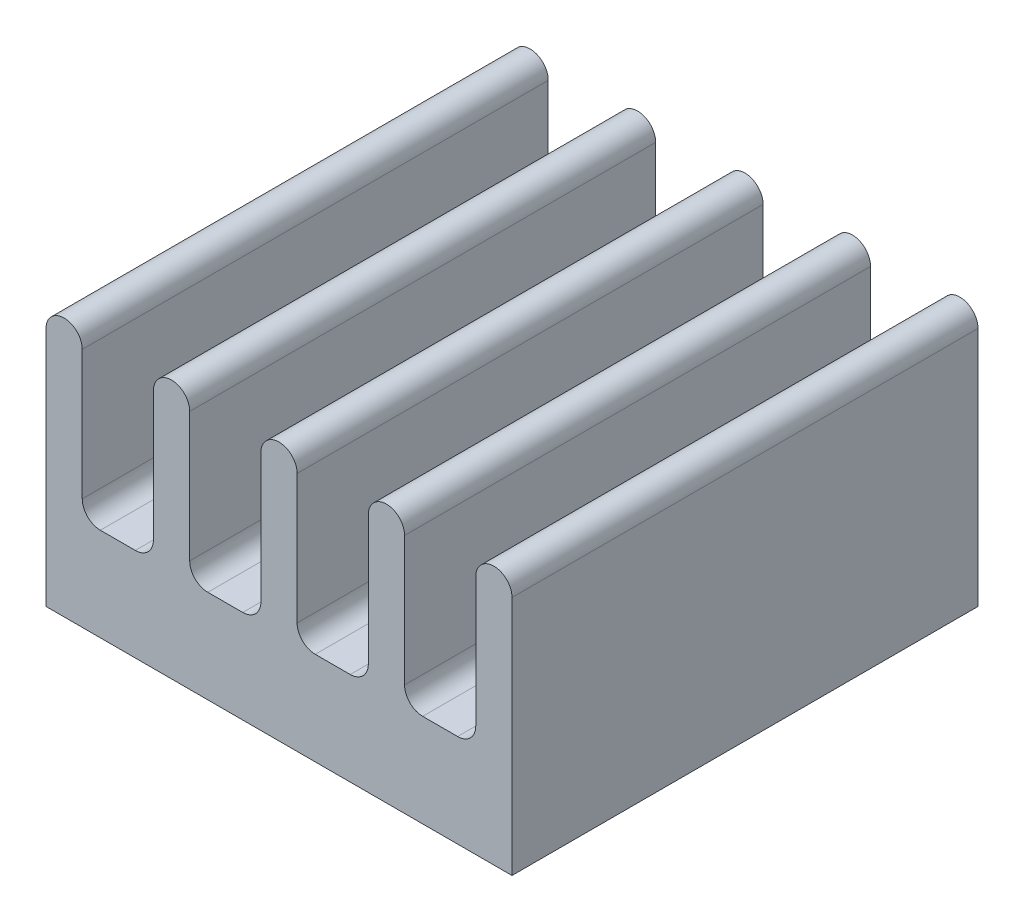
ISO-10303-21;
HEADER;
FILE_DESCRIPTION(('STEP AP214'),'2;1');
FILE_NAME('part.step','',(''),(''),'','','');
FILE_SCHEMA(('AUTOMOTIVE_DESIGN { 1 0 10303 214 1 1 1 1 }'));
ENDSEC;
DATA;
#1=APPLICATION_CONTEXT('core data for automotive mechanical design processes');
#2=APPLICATION_PROTOCOL_DEFINITION('international standard','automotive_design',2000,#1);
#3=PRODUCT_CONTEXT('',#1,'mechanical');
#4=PRODUCT('Part','Part','',(#3));
#5=PRODUCT_RELATED_PRODUCT_CATEGORY('part','',(#4));
#6=PRODUCT_DEFINITION_FORMATION('','',#4);
#7=PRODUCT_DEFINITION_CONTEXT('part definition',#1,'design');
#8=PRODUCT_DEFINITION('design','',#6,#7);
#9=PRODUCT_DEFINITION_SHAPE('','',#8);
#10=(LENGTH_UNIT() NAMED_UNIT(*) SI_UNIT(.MILLI.,.METRE.));
#11=(NAMED_UNIT(*) PLANE_ANGLE_UNIT() SI_UNIT($,.RADIAN.));
#12=(NAMED_UNIT(*) SI_UNIT($,.STERADIAN.) SOLID_ANGLE_UNIT());
#13=UNCERTAINTY_MEASURE_WITH_UNIT(LENGTH_MEASURE(1.E-05),#10,'distance_accuracy_value','');
#14=(GEOMETRIC_REPRESENTATION_CONTEXT(3) GLOBAL_UNCERTAINTY_ASSIGNED_CONTEXT((#13)) GLOBAL_UNIT_ASSIGNED_CONTEXT((#10,
#11,#12)) REPRESENTATION_CONTEXT('',''));
#15=CARTESIAN_POINT('',(0.,0.,0.));
#16=DIRECTION('',(0.,0.,1.));
#17=DIRECTION('',(1.,0.,0.));
#18=AXIS2_PLACEMENT_3D('',#15,#16,#17);
#19=CARTESIAN_POINT('',(4.15,1.8,43.));
#20=DIRECTION('',(0.,1.,0.));
#21=DIRECTION('',(0.,0.,1.));
#22=AXIS2_PLACEMENT_3D('',#19,#20,#21);
#23=PLANE('',#22);
#24=DIRECTION('',(0.,0.,1.));
#25=VECTOR('',#24,1.);
#26=CARTESIAN_POINT('',(2.775,1.8,45.25));
#27=LINE('',#26,#25);
#28=CARTESIAN_POINT('',(2.775,1.8,38.5));
#29=VERTEX_POINT('',#28);
#30=CARTESIAN_POINT('',(2.775,1.8,47.5));
#31=VERTEX_POINT('',#30);
#32=EDGE_CURVE('E284',#29,#31,#27,.T.);
#33=ORIENTED_EDGE('',*,*,#32,.T.);
#34=DIRECTION('',(1.,0.,0.));
#35=VECTOR('',#34,1.);
#36=CARTESIAN_POINT('',(4.15,1.8,47.5));
#37=LINE('',#36,#35);
#38=CARTESIAN_POINT('',(3.45,1.8,47.5));
#39=VERTEX_POINT('',#38);
#40=EDGE_CURVE('E207',#31,#39,#37,.T.);
#41=ORIENTED_EDGE('',*,*,#40,.T.);
#42=DIRECTION('',(0.,0.,-1.));
#43=VECTOR('',#42,1.);
#44=CARTESIAN_POINT('',(3.45,1.8,40.75));
#45=LINE('',#44,#43);
#46=CARTESIAN_POINT('',(3.45,1.8,38.5));
#47=VERTEX_POINT('',#46);
#48=EDGE_CURVE('E212',#39,#47,#45,.T.);
#49=ORIENTED_EDGE('',*,*,#48,.T.);
#50=DIRECTION('',(1.,0.,0.));
#51=VECTOR('',#50,1.);
#52=CARTESIAN_POINT('',(4.15,1.8,38.5));
#53=LINE('',#52,#51);
#54=EDGE_CURVE('E196',#47,#29,#53,.F.);
#55=ORIENTED_EDGE('',*,*,#54,.T.);
#56=EDGE_LOOP('',(#33,#41,#49,#55));
#57=FACE_BOUND('',#56,.T.);
#58=ADVANCED_FACE('F16',(#57),#23,.T.);
#59=CARTESIAN_POINT('',(4.15,1.8,43.));
#60=DIRECTION('',(0.,1.,0.));
#61=DIRECTION('',(0.,0.,1.));
#62=AXIS2_PLACEMENT_3D('',#59,#60,#61);
#63=PLANE('',#62);
#64=DIRECTION('',(0.,0.,1.));
#65=VECTOR('',#64,1.);
#66=CARTESIAN_POINT('',(0.7,1.8,45.25));
#67=LINE('',#66,#65);
#68=CARTESIAN_POINT('',(0.7,1.8,38.5));
#69=VERTEX_POINT('',#68);
#70=CARTESIAN_POINT('',(0.7,1.8,47.5));
#71=VERTEX_POINT('',#70);
#72=EDGE_CURVE('E271',#69,#71,#67,.T.);
#73=ORIENTED_EDGE('',*,*,#72,.T.);
#74=DIRECTION('',(1.,0.,0.));
#75=VECTOR('',#74,1.);
#76=CARTESIAN_POINT('',(4.15,1.8,47.5));
#77=LINE('',#76,#75);
#78=CARTESIAN_POINT('',(1.375,1.8,47.5));
#79=VERTEX_POINT('',#78);
#80=EDGE_CURVE('E290',#71,#79,#77,.T.);
#81=ORIENTED_EDGE('',*,*,#80,.T.);
#82=DIRECTION('',(0.,0.,-1.));
#83=VECTOR('',#82,1.);
#84=CARTESIAN_POINT('',(1.375,1.8,40.75));
#85=LINE('',#84,#83);
#86=CARTESIAN_POINT('',(1.375,1.8,38.5));
#87=VERTEX_POINT('',#86);
#88=EDGE_CURVE('E281',#79,#87,#85,.T.);
#89=ORIENTED_EDGE('',*,*,#88,.T.);
#90=DIRECTION('',(1.,0.,0.));
#91=VECTOR('',#90,1.);
#92=CARTESIAN_POINT('',(4.15,1.8,38.5));
#93=LINE('',#92,#91);
#94=EDGE_CURVE('E293',#87,#69,#93,.F.);
#95=ORIENTED_EDGE('',*,*,#94,.T.);
#96=EDGE_LOOP('',(#73,#81,#89,#95));
#97=FACE_BOUND('',#96,.T.);
#98=ADVANCED_FACE('F538',(#97),#63,.T.);
#99=CARTESIAN_POINT('',(4.15,1.8,43.));
#100=DIRECTION('',(0.,1.,0.));
#101=DIRECTION('',(0.,0.,1.));
#102=AXIS2_PLACEMENT_3D('',#99,#100,#101);
#103=PLANE('',#102);
#104=DIRECTION('',(0.,0.,1.));
#105=VECTOR('',#104,1.);
#106=CARTESIAN_POINT('',(-1.375,1.8,45.25));
#107=LINE('',#106,#105);
#108=CARTESIAN_POINT('',(-1.375,1.8,38.5));
#109=VERTEX_POINT('',#108);
#110=CARTESIAN_POINT('',(-1.375,1.8,47.5));
#111=VERTEX_POINT('',#110);
#112=EDGE_CURVE('E255',#109,#111,#107,.T.);
#113=ORIENTED_EDGE('',*,*,#112,.T.);
#114=DIRECTION('',(1.,0.,0.));
#115=VECTOR('',#114,1.);
#116=CARTESIAN_POINT('',(4.15,1.8,47.5));
#117=LINE('',#116,#115);
#118=CARTESIAN_POINT('',(-0.7,1.8,47.5));
#119=VERTEX_POINT('',#118);
#120=EDGE_CURVE('E299',#111,#119,#117,.T.);
#121=ORIENTED_EDGE('',*,*,#120,.T.);
#122=DIRECTION('',(0.,0.,-1.));
#123=VECTOR('',#122,1.);
#124=CARTESIAN_POINT('',(-0.7,1.8,40.75));
#125=LINE('',#124,#123);
#126=CARTESIAN_POINT('',(-0.7,1.8,38.5));
#127=VERTEX_POINT('',#126);
#128=EDGE_CURVE('E265',#119,#127,#125,.T.);
#129=ORIENTED_EDGE('',*,*,#128,.T.);
#130=DIRECTION('',(1.,0.,0.));
#131=VECTOR('',#130,1.);
#132=CARTESIAN_POINT('',(4.15,1.8,38.5));
#133=LINE('',#132,#131);
#134=EDGE_CURVE('E292',#127,#109,#133,.F.);
#135=ORIENTED_EDGE('',*,*,#134,.T.);
#136=EDGE_LOOP('',(#113,#121,#129,#135));
#137=FACE_BOUND('',#136,.T.);
#138=ADVANCED_FACE('F535',(#137),#103,.T.);
#139=CARTESIAN_POINT('',(4.15,1.8,43.));
#140=DIRECTION('',(0.,1.,0.));
#141=DIRECTION('',(0.,0.,1.));
#142=AXIS2_PLACEMENT_3D('',#139,#140,#141);
#143=PLANE('',#142);
#144=DIRECTION('',(0.,0.,1.));
#145=VECTOR('',#144,1.);
#146=CARTESIAN_POINT('',(-3.45,1.8,45.25));
#147=LINE('',#146,#145);
#148=CARTESIAN_POINT('',(-3.45,1.8,38.5));
#149=VERTEX_POINT('',#148);
#150=CARTESIAN_POINT('',(-3.45,1.8,47.5));
#151=VERTEX_POINT('',#150);
#152=EDGE_CURVE('E239',#149,#151,#147,.T.);
#153=ORIENTED_EDGE('',*,*,#152,.T.);
#154=DIRECTION('',(1.,0.,0.));
#155=VECTOR('',#154,1.);
#156=CARTESIAN_POINT('',(4.15,1.8,47.5));
#157=LINE('',#156,#155);
#158=CARTESIAN_POINT('',(-2.775,1.8,47.5));
#159=VERTEX_POINT('',#158);
#160=EDGE_CURVE('E218',#151,#159,#157,.T.);
#161=ORIENTED_EDGE('',*,*,#160,.T.);
#162=DIRECTION('',(0.,0.,-1.));
#163=VECTOR('',#162,1.);
#164=CARTESIAN_POINT('',(-2.775,1.8,40.75));
#165=LINE('',#164,#163);
#166=CARTESIAN_POINT('',(-2.775,1.8,38.5));
#167=VERTEX_POINT('',#166);
#168=EDGE_CURVE('E249',#159,#167,#165,.T.);
#169=ORIENTED_EDGE('',*,*,#168,.T.);
#170=DIRECTION('',(1.,0.,0.));
#171=VECTOR('',#170,1.);
#172=CARTESIAN_POINT('',(4.15,1.8,38.5));
#173=LINE('',#172,#171);
#174=EDGE_CURVE('E220',#167,#149,#173,.F.);
#175=ORIENTED_EDGE('',*,*,#174,.T.);
#176=EDGE_LOOP('',(#153,#161,#169,#175));
#177=FACE_BOUND('',#176,.T.);
#178=ADVANCED_FACE('F529',(#177),#143,.T.);
#179=CARTESIAN_POINT('',(3.45,2.15,40.75));
#180=DIRECTION('',(0.,0.,-1.));
#181=DIRECTION('',(-1.,0.,0.));
#182=AXIS2_PLACEMENT_3D('',#179,#180,#181);
#183=CYLINDRICAL_SURFACE('',#182,0.35);
#184=DIRECTION('',(0.,0.,1.));
#185=VECTOR('',#184,1.);
#186=CARTESIAN_POINT('',(3.8,2.15,38.5));
#187=LINE('',#186,#185);
#188=CARTESIAN_POINT('',(3.8,2.15,38.5));
#189=VERTEX_POINT('',#188);
#190=CARTESIAN_POINT('',(3.8,2.15,47.5));
#191=VERTEX_POINT('',#190);
#192=EDGE_CURVE('E215',#189,#191,#187,.T.);
#193=ORIENTED_EDGE('',*,*,#192,.F.);
#194=CARTESIAN_POINT('',(3.45,2.15,38.5));
#195=DIRECTION('',(0.,0.,-1.));
#196=DIRECTION('',(-1.,0.,0.));
#197=AXIS2_PLACEMENT_3D('',#194,#195,#196);
#198=CIRCLE('',#197,0.35);
#199=EDGE_CURVE('E19',#47,#189,#198,.F.);
#200=ORIENTED_EDGE('',*,*,#199,.F.);
#201=ORIENTED_EDGE('',*,*,#48,.F.);
#202=CARTESIAN_POINT('',(3.45,2.15,47.5));
#203=DIRECTION('',(0.,0.,-1.));
#204=DIRECTION('',(-1.,0.,0.));
#205=AXIS2_PLACEMENT_3D('',#202,#203,#204);
#206=CIRCLE('',#205,0.35);
#207=EDGE_CURVE('E217',#191,#39,#206,.T.);
#208=ORIENTED_EDGE('',*,*,#207,.F.);
#209=EDGE_LOOP('',(#193,#200,#201,#208));
#210=FACE_BOUND('',#209,.T.);
#211=ADVANCED_FACE('F211',(#210),#183,.F.);
#212=CARTESIAN_POINT('',(2.775,2.15,45.25));
#213=DIRECTION('',(0.,0.,1.));
#214=DIRECTION('',(1.,0.,0.));
#215=AXIS2_PLACEMENT_3D('',#212,#213,#214);
#216=CYLINDRICAL_SURFACE('',#215,0.35);
#217=DIRECTION('',(0.,0.,-1.));
#218=VECTOR('',#217,1.);
#219=CARTESIAN_POINT('',(2.425,2.15,47.5));
#220=LINE('',#219,#218);
#221=CARTESIAN_POINT('',(2.425,2.15,47.5));
#222=VERTEX_POINT('',#221);
#223=CARTESIAN_POINT('',(2.425,2.15,38.5));
#224=VERTEX_POINT('',#223);
#225=EDGE_CURVE('E325',#222,#224,#220,.T.);
#226=ORIENTED_EDGE('',*,*,#225,.F.);
#227=CARTESIAN_POINT('',(2.775,2.15,47.5));
#228=DIRECTION('',(0.,0.,1.));
#229=DIRECTION('',(1.,0.,0.));
#230=AXIS2_PLACEMENT_3D('',#227,#228,#229);
#231=CIRCLE('',#230,0.35);
#232=EDGE_CURVE('E283',#31,#222,#231,.F.);
#233=ORIENTED_EDGE('',*,*,#232,.F.);
#234=ORIENTED_EDGE('',*,*,#32,.F.);
#235=CARTESIAN_POINT('',(2.775,2.15,38.5));
#236=DIRECTION('',(0.,0.,1.));
#237=DIRECTION('',(1.,0.,0.));
#238=AXIS2_PLACEMENT_3D('',#235,#236,#237);
#239=CIRCLE('',#238,0.35);
#240=EDGE_CURVE('E202',#224,#29,#239,.T.);
#241=ORIENTED_EDGE('',*,*,#240,.F.);
#242=EDGE_LOOP('',(#226,#233,#234,#241));
#243=FACE_BOUND('',#242,.T.);
#244=ADVANCED_FACE('F521',(#243),#216,.F.);
#245=CARTESIAN_POINT('',(1.375,2.15,40.75));
#246=DIRECTION('',(0.,0.,-1.));
#247=DIRECTION('',(-1.,0.,0.));
#248=AXIS2_PLACEMENT_3D('',#245,#246,#247);
#249=CYLINDRICAL_SURFACE('',#248,0.35);
#250=DIRECTION('',(0.,0.,1.));
#251=VECTOR('',#250,1.);
#252=CARTESIAN_POINT('',(1.725,2.15,38.5));
#253=LINE('',#252,#251);
#254=CARTESIAN_POINT('',(1.725,2.15,38.5));
#255=VERTEX_POINT('',#254);
#256=CARTESIAN_POINT('',(1.725,2.15,47.5));
#257=VERTEX_POINT('',#256);
#258=EDGE_CURVE('E329',#255,#257,#253,.T.);
#259=ORIENTED_EDGE('',*,*,#258,.F.);
#260=CARTESIAN_POINT('',(1.375,2.15,38.5));
#261=DIRECTION('',(0.,0.,-1.));
#262=DIRECTION('',(-1.,0.,0.));
#263=AXIS2_PLACEMENT_3D('',#260,#261,#262);
#264=CIRCLE('',#263,0.35);
#265=EDGE_CURVE('E279',#87,#255,#264,.F.);
#266=ORIENTED_EDGE('',*,*,#265,.F.);
#267=ORIENTED_EDGE('',*,*,#88,.F.);
#268=CARTESIAN_POINT('',(1.375,2.15,47.5));
#269=DIRECTION('',(0.,0.,-1.));
#270=DIRECTION('',(-1.,0.,0.));
#271=AXIS2_PLACEMENT_3D('',#268,#269,#270);
#272=CIRCLE('',#271,0.35);
#273=EDGE_CURVE('E276',#257,#79,#272,.T.);
#274=ORIENTED_EDGE('',*,*,#273,.F.);
#275=EDGE_LOOP('',(#259,#266,#267,#274));
#276=FACE_BOUND('',#275,.T.);
#277=ADVANCED_FACE('F514',(#276),#249,.F.);
#278=CARTESIAN_POINT('',(2.075,4.65,40.75));
#279=DIRECTION('',(0.,0.,1.));
#280=DIRECTION('',(1.,0.,0.));
#281=AXIS2_PLACEMENT_3D('',#278,#279,#280);
#282=CYLINDRICAL_SURFACE('',#281,0.35);
#283=CARTESIAN_POINT('',(2.075,4.65,38.5));
#284=DIRECTION('',(0.,0.,1.));
#285=DIRECTION('',(1.,0.,0.));
#286=AXIS2_PLACEMENT_3D('',#283,#284,#285);
#287=CIRCLE('',#286,0.35);
#288=CARTESIAN_POINT('',(2.425,4.65,38.5));
#289=VERTEX_POINT('',#288);
#290=CARTESIAN_POINT('',(1.725,4.65,38.5));
#291=VERTEX_POINT('',#290);
#292=EDGE_CURVE('E272',#289,#291,#287,.T.);
#293=ORIENTED_EDGE('',*,*,#292,.T.);
#294=DIRECTION('',(0.,0.,1.));
#295=VECTOR('',#294,1.);
#296=CARTESIAN_POINT('',(1.725,4.65,38.5));
#297=LINE('',#296,#295);
#298=CARTESIAN_POINT('',(1.725,4.65,47.5));
#299=VERTEX_POINT('',#298);
#300=EDGE_CURVE('E334',#299,#291,#297,.F.);
#301=ORIENTED_EDGE('',*,*,#300,.F.);
#302=CARTESIAN_POINT('',(2.075,4.65,47.5));
#303=DIRECTION('',(0.,0.,1.));
#304=DIRECTION('',(1.,0.,0.));
#305=AXIS2_PLACEMENT_3D('',#302,#303,#304);
#306=CIRCLE('',#305,0.35);
#307=CARTESIAN_POINT('',(2.425,4.65,47.5));
#308=VERTEX_POINT('',#307);
#309=EDGE_CURVE('E274',#299,#308,#306,.F.);
#310=ORIENTED_EDGE('',*,*,#309,.T.);
#311=DIRECTION('',(0.,0.,-1.));
#312=VECTOR('',#311,1.);
#313=CARTESIAN_POINT('',(2.425,4.65,47.5));
#314=LINE('',#313,#312);
#315=EDGE_CURVE('E326',#289,#308,#314,.F.);
#316=ORIENTED_EDGE('',*,*,#315,.F.);
#317=EDGE_LOOP('',(#293,#301,#310,#316));
#318=FACE_BOUND('',#317,.T.);
#319=ADVANCED_FACE('F516',(#318),#282,.T.);
#320=CARTESIAN_POINT('',(0.7,2.15,45.25));
#321=DIRECTION('',(0.,0.,1.));
#322=DIRECTION('',(1.,0.,0.));
#323=AXIS2_PLACEMENT_3D('',#320,#321,#322);
#324=CYLINDRICAL_SURFACE('',#323,0.35);
#325=DIRECTION('',(0.,0.,-1.));
#326=VECTOR('',#325,1.);
#327=CARTESIAN_POINT('',(0.35,2.15,47.5));
#328=LINE('',#327,#326);
#329=CARTESIAN_POINT('',(0.35,2.15,47.5));
#330=VERTEX_POINT('',#329);
#331=CARTESIAN_POINT('',(0.35,2.15,38.5));
#332=VERTEX_POINT('',#331);
#333=EDGE_CURVE('E337',#330,#332,#328,.T.);
#334=ORIENTED_EDGE('',*,*,#333,.F.);
#335=CARTESIAN_POINT('',(0.7,2.15,47.5));
#336=DIRECTION('',(0.,0.,1.));
#337=DIRECTION('',(1.,0.,0.));
#338=AXIS2_PLACEMENT_3D('',#335,#336,#337);
#339=CIRCLE('',#338,0.35);
#340=EDGE_CURVE('E269',#71,#330,#339,.F.);
#341=ORIENTED_EDGE('',*,*,#340,.F.);
#342=ORIENTED_EDGE('',*,*,#72,.F.);
#343=CARTESIAN_POINT('',(0.7,2.15,38.5));
#344=DIRECTION('',(0.,0.,1.));
#345=DIRECTION('',(1.,0.,0.));
#346=AXIS2_PLACEMENT_3D('',#343,#344,#345);
#347=CIRCLE('',#346,0.35);
#348=EDGE_CURVE('E266',#332,#69,#347,.T.);
#349=ORIENTED_EDGE('',*,*,#348,.F.);
#350=EDGE_LOOP('',(#334,#341,#342,#349));
#351=FACE_BOUND('',#350,.T.);
#352=ADVANCED_FACE('F549',(#351),#324,.F.);
#353=CARTESIAN_POINT('',(-0.7,2.15,40.75));
#354=DIRECTION('',(0.,0.,-1.));
#355=DIRECTION('',(-1.,0.,0.));
#356=AXIS2_PLACEMENT_3D('',#353,#354,#355);
#357=CYLINDRICAL_SURFACE('',#356,0.35);
#358=DIRECTION('',(0.,0.,1.));
#359=VECTOR('',#358,1.);
#360=CARTESIAN_POINT('',(-0.35,2.15,38.5));
#361=LINE('',#360,#359);
#362=CARTESIAN_POINT('',(-0.35,2.15,38.5));
#363=VERTEX_POINT('',#362);
#364=CARTESIAN_POINT('',(-0.35,2.15,47.5));
#365=VERTEX_POINT('',#364);
#366=EDGE_CURVE('E341',#363,#365,#361,.T.);
#367=ORIENTED_EDGE('',*,*,#366,.F.);
#368=CARTESIAN_POINT('',(-0.7,2.15,38.5));
#369=DIRECTION('',(0.,0.,-1.));
#370=DIRECTION('',(-1.,0.,0.));
#371=AXIS2_PLACEMENT_3D('',#368,#369,#370);
#372=CIRCLE('',#371,0.35);
#373=EDGE_CURVE('E263',#127,#363,#372,.F.);
#374=ORIENTED_EDGE('',*,*,#373,.F.);
#375=ORIENTED_EDGE('',*,*,#128,.F.);
#376=CARTESIAN_POINT('',(-0.7,2.15,47.5));
#377=DIRECTION('',(0.,0.,-1.));
#378=DIRECTION('',(-1.,0.,0.));
#379=AXIS2_PLACEMENT_3D('',#376,#377,#378);
#380=CIRCLE('',#379,0.35);
#381=EDGE_CURVE('E260',#365,#119,#380,.T.);
#382=ORIENTED_EDGE('',*,*,#381,.F.);
#383=EDGE_LOOP('',(#367,#374,#375,#382));
#384=FACE_BOUND('',#383,.T.);
#385=ADVANCED_FACE('F561',(#384),#357,.F.);
#386=CARTESIAN_POINT('',(0.,4.65,40.75));
#387=DIRECTION('',(0.,0.,1.));
#388=DIRECTION('',(1.,0.,0.));
#389=AXIS2_PLACEMENT_3D('',#386,#387,#388);
#390=CYLINDRICAL_SURFACE('',#389,0.35);
#391=CARTESIAN_POINT('',(0.,4.65,38.5));
#392=DIRECTION('',(0.,0.,1.));
#393=DIRECTION('',(1.,0.,0.));
#394=AXIS2_PLACEMENT_3D('',#391,#392,#393);
#395=CIRCLE('',#394,0.35);
#396=CARTESIAN_POINT('',(0.35,4.65,38.5));
#397=VERTEX_POINT('',#396);
#398=CARTESIAN_POINT('',(-0.35,4.65,38.5));
#399=VERTEX_POINT('',#398);
#400=EDGE_CURVE('E256',#397,#399,#395,.T.);
#401=ORIENTED_EDGE('',*,*,#400,.T.);
#402=DIRECTION('',(0.,0.,1.));
#403=VECTOR('',#402,1.);
#404=CARTESIAN_POINT('',(-0.35,4.65,38.5));
#405=LINE('',#404,#403);
#406=CARTESIAN_POINT('',(-0.35,4.65,47.5));
#407=VERTEX_POINT('',#406);
#408=EDGE_CURVE('E346',#407,#399,#405,.F.);
#409=ORIENTED_EDGE('',*,*,#408,.F.);
#410=CARTESIAN_POINT('',(0.,4.65,47.5));
#411=DIRECTION('',(0.,0.,1.));
#412=DIRECTION('',(1.,0.,0.));
#413=AXIS2_PLACEMENT_3D('',#410,#411,#412);
#414=CIRCLE('',#413,0.35);
#415=CARTESIAN_POINT('',(0.35,4.65,47.5));
#416=VERTEX_POINT('',#415);
#417=EDGE_CURVE('E258',#407,#416,#414,.F.);
#418=ORIENTED_EDGE('',*,*,#417,.T.);
#419=DIRECTION('',(0.,0.,-1.));
#420=VECTOR('',#419,1.);
#421=CARTESIAN_POINT('',(0.35,4.65,47.5));
#422=LINE('',#421,#420);
#423=EDGE_CURVE('E338',#397,#416,#422,.F.);
#424=ORIENTED_EDGE('',*,*,#423,.F.);
#425=EDGE_LOOP('',(#401,#409,#418,#424));
#426=FACE_BOUND('',#425,.T.);
#427=ADVANCED_FACE('F556',(#426),#390,.T.);
#428=CARTESIAN_POINT('',(-1.375,2.15,45.25));
#429=DIRECTION('',(0.,0.,1.));
#430=DIRECTION('',(1.,0.,0.));
#431=AXIS2_PLACEMENT_3D('',#428,#429,#430);
#432=CYLINDRICAL_SURFACE('',#431,0.35);
#433=DIRECTION('',(0.,0.,-1.));
#434=VECTOR('',#433,1.);
#435=CARTESIAN_POINT('',(-1.725,2.15,47.5));
#436=LINE('',#435,#434);
#437=CARTESIAN_POINT('',(-1.725,2.15,47.5));
#438=VERTEX_POINT('',#437);
#439=CARTESIAN_POINT('',(-1.725,2.15,38.5));
#440=VERTEX_POINT('',#439);
#441=EDGE_CURVE('E349',#438,#440,#436,.T.);
#442=ORIENTED_EDGE('',*,*,#441,.F.);
#443=CARTESIAN_POINT('',(-1.375,2.15,47.5));
#444=DIRECTION('',(0.,0.,1.));
#445=DIRECTION('',(1.,0.,0.));
#446=AXIS2_PLACEMENT_3D('',#443,#444,#445);
#447=CIRCLE('',#446,0.35);
#448=EDGE_CURVE('E253',#111,#438,#447,.F.);
#449=ORIENTED_EDGE('',*,*,#448,.F.);
#450=ORIENTED_EDGE('',*,*,#112,.F.);
#451=CARTESIAN_POINT('',(-1.375,2.15,38.5));
#452=DIRECTION('',(0.,0.,1.));
#453=DIRECTION('',(1.,0.,0.));
#454=AXIS2_PLACEMENT_3D('',#451,#452,#453);
#455=CIRCLE('',#454,0.35);
#456=EDGE_CURVE('E250',#440,#109,#455,.T.);
#457=ORIENTED_EDGE('',*,*,#456,.F.);
#458=EDGE_LOOP('',(#442,#449,#450,#457));
#459=FACE_BOUND('',#458,.T.);
#460=ADVANCED_FACE('F567',(#459),#432,.F.);
#461=CARTESIAN_POINT('',(-2.775,2.15,40.75));
#462=DIRECTION('',(0.,0.,-1.));
#463=DIRECTION('',(-1.,0.,0.));
#464=AXIS2_PLACEMENT_3D('',#461,#462,#463);
#465=CYLINDRICAL_SURFACE('',#464,0.35);
#466=DIRECTION('',(0.,0.,1.));
#467=VECTOR('',#466,1.);
#468=CARTESIAN_POINT('',(-2.425,2.15,38.5));
#469=LINE('',#468,#467);
#470=CARTESIAN_POINT('',(-2.425,2.15,38.5));
#471=VERTEX_POINT('',#470);
#472=CARTESIAN_POINT('',(-2.425,2.15,47.5));
#473=VERTEX_POINT('',#472);
#474=EDGE_CURVE('E353',#471,#473,#469,.T.);
#475=ORIENTED_EDGE('',*,*,#474,.F.);
#476=CARTESIAN_POINT('',(-2.775,2.15,38.5));
#477=DIRECTION('',(0.,0.,-1.));
#478=DIRECTION('',(-1.,0.,0.));
#479=AXIS2_PLACEMENT_3D('',#476,#477,#478);
#480=CIRCLE('',#479,0.35);
#481=EDGE_CURVE('E247',#167,#471,#480,.F.);
#482=ORIENTED_EDGE('',*,*,#481,.F.);
#483=ORIENTED_EDGE('',*,*,#168,.F.);
#484=CARTESIAN_POINT('',(-2.775,2.15,47.5));
#485=DIRECTION('',(0.,0.,-1.));
#486=DIRECTION('',(-1.,0.,0.));
#487=AXIS2_PLACEMENT_3D('',#484,#485,#486);
#488=CIRCLE('',#487,0.35);
#489=EDGE_CURVE('E244',#473,#159,#488,.T.);
#490=ORIENTED_EDGE('',*,*,#489,.F.);
#491=EDGE_LOOP('',(#475,#482,#483,#490));
#492=FACE_BOUND('',#491,.T.);
#493=ADVANCED_FACE('F579',(#492),#465,.F.);
#494=CARTESIAN_POINT('',(-2.075,4.65,40.75));
#495=DIRECTION('',(0.,0.,1.));
#496=DIRECTION('',(1.,0.,0.));
#497=AXIS2_PLACEMENT_3D('',#494,#495,#496);
#498=CYLINDRICAL_SURFACE('',#497,0.35);
#499=CARTESIAN_POINT('',(-2.075,4.65,38.5));
#500=DIRECTION('',(0.,0.,1.));
#501=DIRECTION('',(1.,0.,0.));
#502=AXIS2_PLACEMENT_3D('',#499,#500,#501);
#503=CIRCLE('',#502,0.35);
#504=CARTESIAN_POINT('',(-1.725,4.65,38.5));
#505=VERTEX_POINT('',#504);
#506=CARTESIAN_POINT('',(-2.425,4.65,38.5));
#507=VERTEX_POINT('',#506);
#508=EDGE_CURVE('E240',#505,#507,#503,.T.);
#509=ORIENTED_EDGE('',*,*,#508,.T.);
#510=DIRECTION('',(0.,0.,1.));
#511=VECTOR('',#510,1.);
#512=CARTESIAN_POINT('',(-2.425,4.65,38.5));
#513=LINE('',#512,#511);
#514=CARTESIAN_POINT('',(-2.425,4.65,47.5));
#515=VERTEX_POINT('',#514);
#516=EDGE_CURVE('E358',#515,#507,#513,.F.);
#517=ORIENTED_EDGE('',*,*,#516,.F.);
#518=CARTESIAN_POINT('',(-2.075,4.65,47.5));
#519=DIRECTION('',(0.,0.,1.));
#520=DIRECTION('',(1.,0.,0.));
#521=AXIS2_PLACEMENT_3D('',#518,#519,#520);
#522=CIRCLE('',#521,0.35);
#523=CARTESIAN_POINT('',(-1.725,4.65,47.5));
#524=VERTEX_POINT('',#523);
#525=EDGE_CURVE('E242',#515,#524,#522,.F.);
#526=ORIENTED_EDGE('',*,*,#525,.T.);
#527=DIRECTION('',(0.,0.,-1.));
#528=VECTOR('',#527,1.);
#529=CARTESIAN_POINT('',(-1.725,4.65,47.5));
#530=LINE('',#529,#528);
#531=EDGE_CURVE('E350',#505,#524,#530,.F.);
#532=ORIENTED_EDGE('',*,*,#531,.F.);
#533=EDGE_LOOP('',(#509,#517,#526,#532));
#534=FACE_BOUND('',#533,.T.);
#535=ADVANCED_FACE('F574',(#534),#498,.T.);
#536=CARTESIAN_POINT('',(-3.45,2.15,45.25));
#537=DIRECTION('',(0.,0.,1.));
#538=DIRECTION('',(1.,0.,0.));
#539=AXIS2_PLACEMENT_3D('',#536,#537,#538);
#540=CYLINDRICAL_SURFACE('',#539,0.35);
#541=DIRECTION('',(0.,0.,-1.));
#542=VECTOR('',#541,1.);
#543=CARTESIAN_POINT('',(-3.8,2.15,47.5));
#544=LINE('',#543,#542);
#545=CARTESIAN_POINT('',(-3.8,2.15,47.5));
#546=VERTEX_POINT('',#545);
#547=CARTESIAN_POINT('',(-3.8,2.15,38.5));
#548=VERTEX_POINT('',#547);
#549=EDGE_CURVE('E361',#546,#548,#544,.T.);
#550=ORIENTED_EDGE('',*,*,#549,.F.);
#551=CARTESIAN_POINT('',(-3.45,2.15,47.5));
#552=DIRECTION('',(0.,0.,1.));
#553=DIRECTION('',(1.,0.,0.));
#554=AXIS2_PLACEMENT_3D('',#551,#552,#553);
#555=CIRCLE('',#554,0.35);
#556=EDGE_CURVE('E237',#151,#546,#555,.F.);
#557=ORIENTED_EDGE('',*,*,#556,.F.);
#558=ORIENTED_EDGE('',*,*,#152,.F.);
#559=CARTESIAN_POINT('',(-3.45,2.15,38.5));
#560=DIRECTION('',(0.,0.,1.));
#561=DIRECTION('',(1.,0.,0.));
#562=AXIS2_PLACEMENT_3D('',#559,#560,#561);
#563=CIRCLE('',#562,0.35);
#564=EDGE_CURVE('E234',#548,#149,#563,.T.);
#565=ORIENTED_EDGE('',*,*,#564,.F.);
#566=EDGE_LOOP('',(#550,#557,#558,#565));
#567=FACE_BOUND('',#566,.T.);
#568=ADVANCED_FACE('F585',(#567),#540,.F.);
#569=CARTESIAN_POINT('',(4.15,4.65,40.75));
#570=DIRECTION('',(0.,0.,1.));
#571=DIRECTION('',(1.,0.,0.));
#572=AXIS2_PLACEMENT_3D('',#569,#570,#571);
#573=CYLINDRICAL_SURFACE('',#572,0.35);
#574=CARTESIAN_POINT('',(4.15,4.65,38.5));
#575=DIRECTION('',(0.,0.,1.));
#576=DIRECTION('',(1.,0.,0.));
#577=AXIS2_PLACEMENT_3D('',#574,#575,#576);
#578=CIRCLE('',#577,0.35);
#579=CARTESIAN_POINT('',(4.5,4.65,38.5));
#580=VERTEX_POINT('',#579);
#581=CARTESIAN_POINT('',(3.8,4.65,38.5));
#582=VERTEX_POINT('',#581);
#583=EDGE_CURVE('E230',#580,#582,#578,.T.);
#584=ORIENTED_EDGE('',*,*,#583,.T.);
#585=DIRECTION('',(0.,0.,1.));
#586=VECTOR('',#585,1.);
#587=CARTESIAN_POINT('',(3.8,4.65,38.5));
#588=LINE('',#587,#586);
#589=CARTESIAN_POINT('',(3.8,4.65,47.5));
#590=VERTEX_POINT('',#589);
#591=EDGE_CURVE('E322',#590,#582,#588,.F.);
#592=ORIENTED_EDGE('',*,*,#591,.F.);
#593=CARTESIAN_POINT('',(4.15,4.65,47.5));
#594=DIRECTION('',(0.,0.,1.));
#595=DIRECTION('',(1.,0.,0.));
#596=AXIS2_PLACEMENT_3D('',#593,#594,#595);
#597=CIRCLE('',#596,0.35);
#598=CARTESIAN_POINT('',(4.5,4.65,47.5));
#599=VERTEX_POINT('',#598);
#600=EDGE_CURVE('E232',#590,#599,#597,.F.);
#601=ORIENTED_EDGE('',*,*,#600,.T.);
#602=DIRECTION('',(0.,0.,-1.));
#603=VECTOR('',#602,1.);
#604=CARTESIAN_POINT('',(4.5,4.65,47.5));
#605=LINE('',#604,#603);
#606=EDGE_CURVE('E365',#580,#599,#605,.F.);
#607=ORIENTED_EDGE('',*,*,#606,.F.);
#608=EDGE_LOOP('',(#584,#592,#601,#607));
#609=FACE_BOUND('',#608,.T.);
#610=ADVANCED_FACE('F448',(#609),#573,.T.);
#611=CARTESIAN_POINT('',(-4.15,4.65,40.75));
#612=DIRECTION('',(0.,0.,1.));
#613=DIRECTION('',(1.,0.,0.));
#614=AXIS2_PLACEMENT_3D('',#611,#612,#613);
#615=CYLINDRICAL_SURFACE('',#614,0.35);
#616=CARTESIAN_POINT('',(-4.15,4.65,38.5));
#617=DIRECTION('',(0.,0.,1.));
#618=DIRECTION('',(1.,0.,0.));
#619=AXIS2_PLACEMENT_3D('',#616,#617,#618);
#620=CIRCLE('',#619,0.35);
#621=CARTESIAN_POINT('',(-4.5,4.65,38.5));
#622=VERTEX_POINT('',#621);
#623=CARTESIAN_POINT('',(-3.8,4.65,38.5));
#624=VERTEX_POINT('',#623);
#625=EDGE_CURVE('E224',#622,#624,#620,.F.);
#626=ORIENTED_EDGE('',*,*,#625,.F.);
#627=DIRECTION('',(0.,0.,1.));
#628=VECTOR('',#627,1.);
#629=CARTESIAN_POINT('',(-4.5,4.65,38.5));
#630=LINE('',#629,#628);
#631=CARTESIAN_POINT('',(-4.5,4.65,47.5));
#632=VERTEX_POINT('',#631);
#633=EDGE_CURVE('E320',#632,#622,#630,.F.);
#634=ORIENTED_EDGE('',*,*,#633,.F.);
#635=CARTESIAN_POINT('',(-4.15,4.65,47.5));
#636=DIRECTION('',(0.,0.,1.));
#637=DIRECTION('',(1.,0.,0.));
#638=AXIS2_PLACEMENT_3D('',#635,#636,#637);
#639=CIRCLE('',#638,0.35);
#640=CARTESIAN_POINT('',(-3.8,4.65,47.5));
#641=VERTEX_POINT('',#640);
#642=EDGE_CURVE('E228',#632,#641,#639,.F.);
#643=ORIENTED_EDGE('',*,*,#642,.T.);
#644=DIRECTION('',(0.,0.,-1.));
#645=VECTOR('',#644,1.);
#646=CARTESIAN_POINT('',(-3.8,4.65,47.5));
#647=LINE('',#646,#645);
#648=EDGE_CURVE('E362',#624,#641,#647,.F.);
#649=ORIENTED_EDGE('',*,*,#648,.F.);
#650=EDGE_LOOP('',(#626,#634,#643,#649));
#651=FACE_BOUND('',#650,.T.);
#652=ADVANCED_FACE('F454',(#651),#615,.T.);
#653=CARTESIAN_POINT('',(3.8,0.,38.5));
#654=DIRECTION('',(-1.,0.,0.));
#655=DIRECTION('',(0.,0.,1.));
#656=AXIS2_PLACEMENT_3D('',#653,#654,#655);
#657=PLANE('',#656);
#658=ORIENTED_EDGE('',*,*,#591,.T.);
#659=DIRECTION('',(0.,1.,0.));
#660=VECTOR('',#659,1.);
#661=CARTESIAN_POINT('',(3.8,0.,38.5));
#662=LINE('',#661,#660);
#663=EDGE_CURVE('E373',#189,#582,#662,.T.);
#664=ORIENTED_EDGE('',*,*,#663,.F.);
#665=ORIENTED_EDGE('',*,*,#192,.T.);
#666=DIRECTION('',(0.,1.,0.));
#667=VECTOR('',#666,1.);
#668=CARTESIAN_POINT('',(3.8,0.,47.5));
#669=LINE('',#668,#667);
#670=EDGE_CURVE('E319',#590,#191,#669,.F.);
#671=ORIENTED_EDGE('',*,*,#670,.F.);
#672=EDGE_LOOP('',(#658,#664,#665,#671));
#673=FACE_BOUND('',#672,.T.);
#674=ADVANCED_FACE('F451',(#673),#657,.T.);
#675=CARTESIAN_POINT('',(2.425,0.,47.5));
#676=DIRECTION('',(1.,0.,0.));
#677=DIRECTION('',(0.,0.,-1.));
#678=AXIS2_PLACEMENT_3D('',#675,#676,#677);
#679=PLANE('',#678);
#680=ORIENTED_EDGE('',*,*,#315,.T.);
#681=DIRECTION('',(0.,1.,0.));
#682=VECTOR('',#681,1.);
#683=CARTESIAN_POINT('',(2.425,0.,47.5));
#684=LINE('',#683,#682);
#685=EDGE_CURVE('E407',#222,#308,#684,.T.);
#686=ORIENTED_EDGE('',*,*,#685,.F.);
#687=ORIENTED_EDGE('',*,*,#225,.T.);
#688=DIRECTION('',(0.,1.,0.));
#689=VECTOR('',#688,1.);
#690=CARTESIAN_POINT('',(2.425,0.,38.5));
#691=LINE('',#690,#689);
#692=EDGE_CURVE('E403',#289,#224,#691,.F.);
#693=ORIENTED_EDGE('',*,*,#692,.F.);
#694=EDGE_LOOP('',(#680,#686,#687,#693));
#695=FACE_BOUND('',#694,.T.);
#696=ADVANCED_FACE('F453',(#695),#679,.T.);
#697=CARTESIAN_POINT('',(1.725,0.,38.5));
#698=DIRECTION('',(-1.,0.,0.));
#699=DIRECTION('',(0.,0.,1.));
#700=AXIS2_PLACEMENT_3D('',#697,#698,#699);
#701=PLANE('',#700);
#702=ORIENTED_EDGE('',*,*,#300,.T.);
#703=DIRECTION('',(0.,1.,0.));
#704=VECTOR('',#703,1.);
#705=CARTESIAN_POINT('',(1.725,0.,38.5));
#706=LINE('',#705,#704);
#707=EDGE_CURVE('E400',#255,#291,#706,.T.);
#708=ORIENTED_EDGE('',*,*,#707,.F.);
#709=ORIENTED_EDGE('',*,*,#258,.T.);
#710=DIRECTION('',(0.,1.,0.));
#711=VECTOR('',#710,1.);
#712=CARTESIAN_POINT('',(1.725,0.,47.5));
#713=LINE('',#712,#711);
#714=EDGE_CURVE('E410',#299,#257,#713,.F.);
#715=ORIENTED_EDGE('',*,*,#714,.F.);
#716=EDGE_LOOP('',(#702,#708,#709,#715));
#717=FACE_BOUND('',#716,.T.);
#718=ADVANCED_FACE('F461',(#717),#701,.T.);
#719=CARTESIAN_POINT('',(0.35,0.,47.5));
#720=DIRECTION('',(1.,0.,0.));
#721=DIRECTION('',(0.,0.,-1.));
#722=AXIS2_PLACEMENT_3D('',#719,#720,#721);
#723=PLANE('',#722);
#724=ORIENTED_EDGE('',*,*,#423,.T.);
#725=DIRECTION('',(0.,1.,0.));
#726=VECTOR('',#725,1.);
#727=CARTESIAN_POINT('',(0.35,0.,47.5));
#728=LINE('',#727,#726);
#729=EDGE_CURVE('E413',#330,#416,#728,.T.);
#730=ORIENTED_EDGE('',*,*,#729,.F.);
#731=ORIENTED_EDGE('',*,*,#333,.T.);
#732=DIRECTION('',(0.,1.,0.));
#733=VECTOR('',#732,1.);
#734=CARTESIAN_POINT('',(0.35,0.,38.5));
#735=LINE('',#734,#733);
#736=EDGE_CURVE('E397',#397,#332,#735,.F.);
#737=ORIENTED_EDGE('',*,*,#736,.F.);
#738=EDGE_LOOP('',(#724,#730,#731,#737));
#739=FACE_BOUND('',#738,.T.);
#740=ADVANCED_FACE('F496',(#739),#723,.T.);
#741=CARTESIAN_POINT('',(-0.35,0.,38.5));
#742=DIRECTION('',(-1.,0.,0.));
#743=DIRECTION('',(0.,0.,1.));
#744=AXIS2_PLACEMENT_3D('',#741,#742,#743);
#745=PLANE('',#744);
#746=ORIENTED_EDGE('',*,*,#408,.T.);
#747=DIRECTION('',(0.,1.,0.));
#748=VECTOR('',#747,1.);
#749=CARTESIAN_POINT('',(-0.35,0.,38.5));
#750=LINE('',#749,#748);
#751=EDGE_CURVE('E394',#363,#399,#750,.T.);
#752=ORIENTED_EDGE('',*,*,#751,.F.);
#753=ORIENTED_EDGE('',*,*,#366,.T.);
#754=DIRECTION('',(0.,1.,0.));
#755=VECTOR('',#754,1.);
#756=CARTESIAN_POINT('',(-0.35,0.,47.5));
#757=LINE('',#756,#755);
#758=EDGE_CURVE('E416',#407,#365,#757,.F.);
#759=ORIENTED_EDGE('',*,*,#758,.F.);
#760=EDGE_LOOP('',(#746,#752,#753,#759));
#761=FACE_BOUND('',#760,.T.);
#762=ADVANCED_FACE('F492',(#761),#745,.T.);
#763=CARTESIAN_POINT('',(-1.725,0.,47.5));
#764=DIRECTION('',(1.,0.,0.));
#765=DIRECTION('',(0.,0.,-1.));
#766=AXIS2_PLACEMENT_3D('',#763,#764,#765);
#767=PLANE('',#766);
#768=ORIENTED_EDGE('',*,*,#531,.T.);
#769=DIRECTION('',(0.,1.,0.));
#770=VECTOR('',#769,1.);
#771=CARTESIAN_POINT('',(-1.725,0.,47.5));
#772=LINE('',#771,#770);
#773=EDGE_CURVE('E419',#438,#524,#772,.T.);
#774=ORIENTED_EDGE('',*,*,#773,.F.);
#775=ORIENTED_EDGE('',*,*,#441,.T.);
#776=DIRECTION('',(0.,1.,0.));
#777=VECTOR('',#776,1.);
#778=CARTESIAN_POINT('',(-1.725,0.,38.5));
#779=LINE('',#778,#777);
#780=EDGE_CURVE('E391',#505,#440,#779,.F.);
#781=ORIENTED_EDGE('',*,*,#780,.F.);
#782=EDGE_LOOP('',(#768,#774,#775,#781));
#783=FACE_BOUND('',#782,.T.);
#784=ADVANCED_FACE('F488',(#783),#767,.T.);
#785=CARTESIAN_POINT('',(-2.425,0.,38.5));
#786=DIRECTION('',(-1.,0.,0.));
#787=DIRECTION('',(0.,0.,1.));
#788=AXIS2_PLACEMENT_3D('',#785,#786,#787);
#789=PLANE('',#788);
#790=ORIENTED_EDGE('',*,*,#516,.T.);
#791=DIRECTION('',(0.,1.,0.));
#792=VECTOR('',#791,1.);
#793=CARTESIAN_POINT('',(-2.425,0.,38.5));
#794=LINE('',#793,#792);
#795=EDGE_CURVE('E388',#471,#507,#794,.T.);
#796=ORIENTED_EDGE('',*,*,#795,.F.);
#797=ORIENTED_EDGE('',*,*,#474,.T.);
#798=DIRECTION('',(0.,1.,0.));
#799=VECTOR('',#798,1.);
#800=CARTESIAN_POINT('',(-2.425,0.,47.5));
#801=LINE('',#800,#799);
#802=EDGE_CURVE('E422',#515,#473,#801,.F.);
#803=ORIENTED_EDGE('',*,*,#802,.F.);
#804=EDGE_LOOP('',(#790,#796,#797,#803));
#805=FACE_BOUND('',#804,.T.);
#806=ADVANCED_FACE('F484',(#805),#789,.T.);
#807=CARTESIAN_POINT('',(-3.8,0.,47.5));
#808=DIRECTION('',(1.,0.,0.));
#809=DIRECTION('',(0.,0.,-1.));
#810=AXIS2_PLACEMENT_3D('',#807,#808,#809);
#811=PLANE('',#810);
#812=ORIENTED_EDGE('',*,*,#648,.T.);
#813=DIRECTION('',(0.,1.,0.));
#814=VECTOR('',#813,1.);
#815=CARTESIAN_POINT('',(-3.8,0.,47.5));
#816=LINE('',#815,#814);
#817=EDGE_CURVE('E425',#546,#641,#816,.T.);
#818=ORIENTED_EDGE('',*,*,#817,.F.);
#819=ORIENTED_EDGE('',*,*,#549,.T.);
#820=DIRECTION('',(0.,1.,0.));
#821=VECTOR('',#820,1.);
#822=CARTESIAN_POINT('',(-3.8,0.,38.5));
#823=LINE('',#822,#821);
#824=EDGE_CURVE('E226',#624,#548,#823,.F.);
#825=ORIENTED_EDGE('',*,*,#824,.F.);
#826=EDGE_LOOP('',(#812,#818,#819,#825));
#827=FACE_BOUND('',#826,.T.);
#828=ADVANCED_FACE('F481',(#827),#811,.T.);
#829=CARTESIAN_POINT('',(4.5,0.,47.5));
#830=DIRECTION('',(1.,0.,0.));
#831=DIRECTION('',(0.,0.,-1.));
#832=AXIS2_PLACEMENT_3D('',#829,#830,#831);
#833=PLANE('',#832);
#834=DIRECTION('',(0.,0.,1.));
#835=VECTOR('',#834,1.);
#836=CARTESIAN_POINT('',(4.5,0.,43.));
#837=LINE('',#836,#835);
#838=CARTESIAN_POINT('',(4.5,0.,47.5));
#839=VERTEX_POINT('',#838);
#840=CARTESIAN_POINT('',(4.5,0.,38.5));
#841=VERTEX_POINT('',#840);
#842=EDGE_CURVE('E314',#839,#841,#837,.F.);
#843=ORIENTED_EDGE('',*,*,#842,.T.);
#844=DIRECTION('',(0.,1.,0.));
#845=VECTOR('',#844,1.);
#846=CARTESIAN_POINT('',(4.5,0.,38.5));
#847=LINE('',#846,#845);
#848=EDGE_CURVE('E227',#580,#841,#847,.F.);
#849=ORIENTED_EDGE('',*,*,#848,.F.);
#850=ORIENTED_EDGE('',*,*,#606,.T.);
#851=DIRECTION('',(0.,1.,0.));
#852=VECTOR('',#851,1.);
#853=CARTESIAN_POINT('',(4.5,0.,47.5));
#854=LINE('',#853,#852);
#855=EDGE_CURVE('E380',#839,#599,#854,.T.);
#856=ORIENTED_EDGE('',*,*,#855,.F.);
#857=EDGE_LOOP('',(#843,#849,#850,#856));
#858=FACE_BOUND('',#857,.T.);
#859=ADVANCED_FACE('F438',(#858),#833,.T.);
#860=CARTESIAN_POINT('',(4.5,0.,38.5));
#861=DIRECTION('',(0.,0.,-1.));
#862=DIRECTION('',(-1.,0.,0.));
#863=AXIS2_PLACEMENT_3D('',#860,#861,#862);
#864=PLANE('',#863);
#865=ORIENTED_EDGE('',*,*,#199,.T.);
#866=ORIENTED_EDGE('',*,*,#663,.T.);
#867=ORIENTED_EDGE('',*,*,#583,.F.);
#868=ORIENTED_EDGE('',*,*,#848,.T.);
#869=DIRECTION('',(1.,0.,0.));
#870=VECTOR('',#869,1.);
#871=CARTESIAN_POINT('',(4.15,0.,38.5));
#872=LINE('',#871,#870);
#873=CARTESIAN_POINT('',(-4.5,0.,38.5));
#874=VERTEX_POINT('',#873);
#875=EDGE_CURVE('E311',#841,#874,#872,.F.);
#876=ORIENTED_EDGE('',*,*,#875,.T.);
#877=DIRECTION('',(0.,1.,0.));
#878=VECTOR('',#877,1.);
#879=CARTESIAN_POINT('',(-4.5,0.,38.5));
#880=LINE('',#879,#878);
#881=EDGE_CURVE('E317',#622,#874,#880,.F.);
#882=ORIENTED_EDGE('',*,*,#881,.F.);
#883=ORIENTED_EDGE('',*,*,#625,.T.);
#884=ORIENTED_EDGE('',*,*,#824,.T.);
#885=ORIENTED_EDGE('',*,*,#564,.T.);
#886=ORIENTED_EDGE('',*,*,#174,.F.);
#887=ORIENTED_EDGE('',*,*,#481,.T.);
#888=ORIENTED_EDGE('',*,*,#795,.T.);
#889=ORIENTED_EDGE('',*,*,#508,.F.);
#890=ORIENTED_EDGE('',*,*,#780,.T.);
#891=ORIENTED_EDGE('',*,*,#456,.T.);
#892=ORIENTED_EDGE('',*,*,#134,.F.);
#893=ORIENTED_EDGE('',*,*,#373,.T.);
#894=ORIENTED_EDGE('',*,*,#751,.T.);
#895=ORIENTED_EDGE('',*,*,#400,.F.);
#896=ORIENTED_EDGE('',*,*,#736,.T.);
#897=ORIENTED_EDGE('',*,*,#348,.T.);
#898=ORIENTED_EDGE('',*,*,#94,.F.);
#899=ORIENTED_EDGE('',*,*,#265,.T.);
#900=ORIENTED_EDGE('',*,*,#707,.T.);
#901=ORIENTED_EDGE('',*,*,#292,.F.);
#902=ORIENTED_EDGE('',*,*,#692,.T.);
#903=ORIENTED_EDGE('',*,*,#240,.T.);
#904=ORIENTED_EDGE('',*,*,#54,.F.);
#905=EDGE_LOOP('',(#865,#866,#867,#868,#876,#882,#883,#884,#885,#886,#887,#888,#889,#890,#891,
#892,#893,#894,#895,#896,#897,#898,#899,#900,#901,#902,#903,#904));
#906=FACE_BOUND('',#905,.T.);
#907=ADVANCED_FACE('F198',(#906),#864,.T.);
#908=CARTESIAN_POINT('',(-4.5,0.,38.5));
#909=DIRECTION('',(-1.,0.,0.));
#910=DIRECTION('',(0.,0.,1.));
#911=AXIS2_PLACEMENT_3D('',#908,#909,#910);
#912=PLANE('',#911);
#913=DIRECTION('',(0.,0.,1.));
#914=VECTOR('',#913,1.);
#915=CARTESIAN_POINT('',(-4.5,0.,43.));
#916=LINE('',#915,#914);
#917=CARTESIAN_POINT('',(-4.5,0.,47.5));
#918=VERTEX_POINT('',#917);
#919=EDGE_CURVE('E25',#874,#918,#916,.T.);
#920=ORIENTED_EDGE('',*,*,#919,.T.);
#921=DIRECTION('',(0.,1.,0.));
#922=VECTOR('',#921,1.);
#923=CARTESIAN_POINT('',(-4.5,0.,47.5));
#924=LINE('',#923,#922);
#925=EDGE_CURVE('E33',#632,#918,#924,.F.);
#926=ORIENTED_EDGE('',*,*,#925,.F.);
#927=ORIENTED_EDGE('',*,*,#633,.T.);
#928=ORIENTED_EDGE('',*,*,#881,.T.);
#929=EDGE_LOOP('',(#920,#926,#927,#928));
#930=FACE_BOUND('',#929,.T.);
#931=ADVANCED_FACE('F471',(#930),#912,.T.);
#932=CARTESIAN_POINT('',(-4.5,0.,47.5));
#933=DIRECTION('',(0.,0.,1.));
#934=DIRECTION('',(1.,0.,0.));
#935=AXIS2_PLACEMENT_3D('',#932,#933,#934);
#936=PLANE('',#935);
#937=DIRECTION('',(1.,0.,0.));
#938=VECTOR('',#937,1.);
#939=CARTESIAN_POINT('',(4.15,0.,47.5));
#940=LINE('',#939,#938);
#941=EDGE_CURVE('E10',#918,#839,#940,.T.);
#942=ORIENTED_EDGE('',*,*,#941,.T.);
#943=ORIENTED_EDGE('',*,*,#855,.T.);
#944=ORIENTED_EDGE('',*,*,#600,.F.);
#945=ORIENTED_EDGE('',*,*,#670,.T.);
#946=ORIENTED_EDGE('',*,*,#207,.T.);
#947=ORIENTED_EDGE('',*,*,#40,.F.);
#948=ORIENTED_EDGE('',*,*,#232,.T.);
#949=ORIENTED_EDGE('',*,*,#685,.T.);
#950=ORIENTED_EDGE('',*,*,#309,.F.);
#951=ORIENTED_EDGE('',*,*,#714,.T.);
#952=ORIENTED_EDGE('',*,*,#273,.T.);
#953=ORIENTED_EDGE('',*,*,#80,.F.);
#954=ORIENTED_EDGE('',*,*,#340,.T.);
#955=ORIENTED_EDGE('',*,*,#729,.T.);
#956=ORIENTED_EDGE('',*,*,#417,.F.);
#957=ORIENTED_EDGE('',*,*,#758,.T.);
#958=ORIENTED_EDGE('',*,*,#381,.T.);
#959=ORIENTED_EDGE('',*,*,#120,.F.);
#960=ORIENTED_EDGE('',*,*,#448,.T.);
#961=ORIENTED_EDGE('',*,*,#773,.T.);
#962=ORIENTED_EDGE('',*,*,#525,.F.);
#963=ORIENTED_EDGE('',*,*,#802,.T.);
#964=ORIENTED_EDGE('',*,*,#489,.T.);
#965=ORIENTED_EDGE('',*,*,#160,.F.);
#966=ORIENTED_EDGE('',*,*,#556,.T.);
#967=ORIENTED_EDGE('',*,*,#817,.T.);
#968=ORIENTED_EDGE('',*,*,#642,.F.);
#969=ORIENTED_EDGE('',*,*,#925,.T.);
#970=EDGE_LOOP('',(#942,#943,#944,#945,#946,#947,#948,#949,#950,#951,#952,#953,#954,#955,#956,
#957,#958,#959,#960,#961,#962,#963,#964,#965,#966,#967,#968,#969));
#971=FACE_BOUND('',#970,.T.);
#972=ADVANCED_FACE('F435',(#971),#936,.T.);
#973=CARTESIAN_POINT('',(4.15,0.,43.));
#974=DIRECTION('',(0.,1.,0.));
#975=DIRECTION('',(0.,0.,1.));
#976=AXIS2_PLACEMENT_3D('',#973,#974,#975);
#977=PLANE('',#976);
#978=ORIENTED_EDGE('',*,*,#919,.F.);
#979=ORIENTED_EDGE('',*,*,#875,.F.);
#980=ORIENTED_EDGE('',*,*,#842,.F.);
#981=ORIENTED_EDGE('',*,*,#941,.F.);
#982=EDGE_LOOP('',(#978,#979,#980,#981));
#983=FACE_BOUND('',#982,.T.);
#984=ADVANCED_FACE('F445',(#983),#977,.F.);
#985=CLOSED_SHELL('',(#58,#98,#138,#178,#211,#244,#277,#319,#352,#385,#427,#460,#493,#535,#568,
#610,#652,#674,#696,#718,#740,#762,#784,#806,#828,#859,#907,#931,#972,#984));
#986=MANIFOLD_SOLID_BREP('B1',#985);
#987=ADVANCED_BREP_SHAPE_REPRESENTATION('',(#18,#986),#14);
#988=SHAPE_DEFINITION_REPRESENTATION(#9,#987);
ENDSEC;
END-ISO-10303-21;
